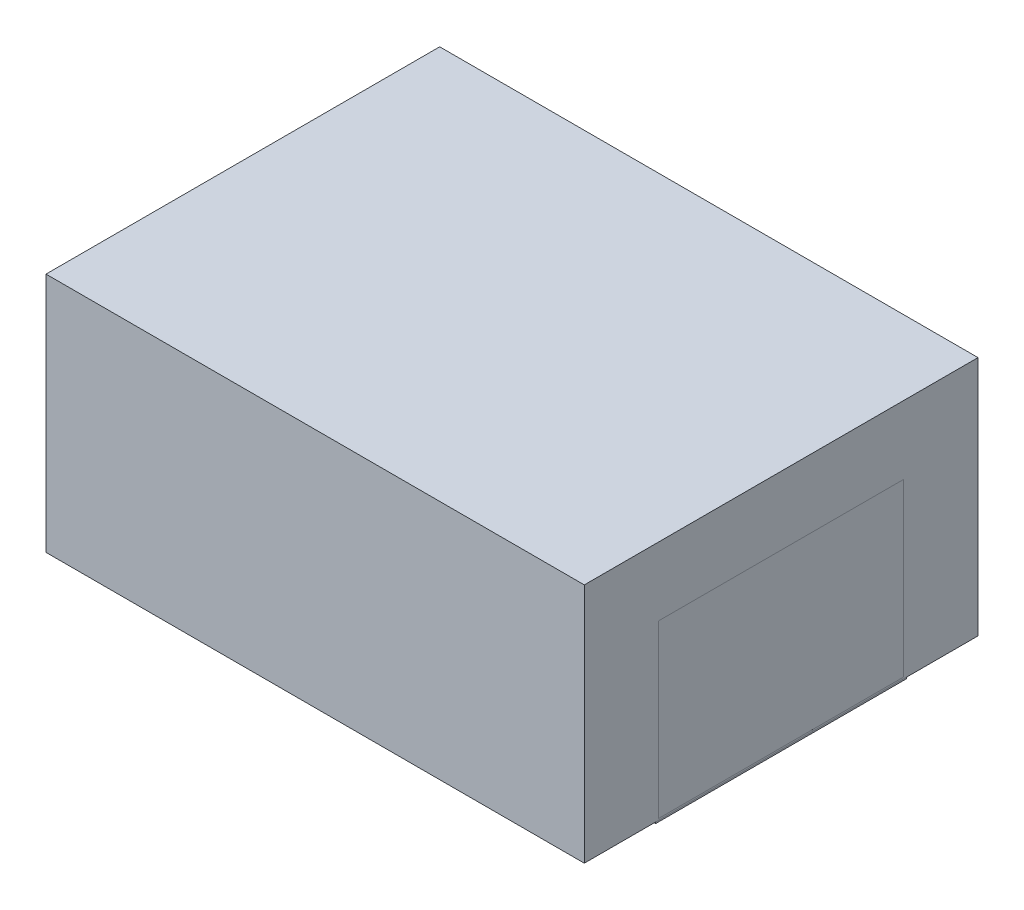
ISO-10303-21;
HEADER;
FILE_DESCRIPTION(('STEP AP214'),'2;1');
FILE_NAME('part.step','',(''),(''),'','','');
FILE_SCHEMA(('AUTOMOTIVE_DESIGN { 1 0 10303 214 1 1 1 1 }'));
ENDSEC;
DATA;
#1=APPLICATION_CONTEXT('core data for automotive mechanical design processes');
#2=APPLICATION_PROTOCOL_DEFINITION('international standard','automotive_design',2000,#1);
#3=PRODUCT_CONTEXT('',#1,'mechanical');
#4=PRODUCT('Part','Part','',(#3));
#5=PRODUCT_RELATED_PRODUCT_CATEGORY('part','',(#4));
#6=PRODUCT_DEFINITION_FORMATION('','',#4);
#7=PRODUCT_DEFINITION_CONTEXT('part definition',#1,'design');
#8=PRODUCT_DEFINITION('design','',#6,#7);
#9=PRODUCT_DEFINITION_SHAPE('','',#8);
#10=(LENGTH_UNIT() NAMED_UNIT(*) SI_UNIT(.MILLI.,.METRE.));
#11=(NAMED_UNIT(*) PLANE_ANGLE_UNIT() SI_UNIT($,.RADIAN.));
#12=(NAMED_UNIT(*) SI_UNIT($,.STERADIAN.) SOLID_ANGLE_UNIT());
#13=UNCERTAINTY_MEASURE_WITH_UNIT(LENGTH_MEASURE(1.E-05),#10,'distance_accuracy_value','');
#14=(GEOMETRIC_REPRESENTATION_CONTEXT(3) GLOBAL_UNCERTAINTY_ASSIGNED_CONTEXT((#13)) GLOBAL_UNIT_ASSIGNED_CONTEXT((#10,
#11,#12)) REPRESENTATION_CONTEXT('',''));
#15=CARTESIAN_POINT('',(0.,0.,0.));
#16=DIRECTION('',(0.,0.,1.));
#17=DIRECTION('',(1.,0.,0.));
#18=AXIS2_PLACEMENT_3D('',#15,#16,#17);
#19=CARTESIAN_POINT('',(6685.,0.,0.));
#20=DIRECTION('',(1.,0.,0.));
#21=DIRECTION('',(0.,0.,-1.));
#22=AXIS2_PLACEMENT_3D('',#19,#20,#21);
#23=PLANE('',#22);
#24=DIRECTION('',(0.,0.,1.));
#25=VECTOR('',#24,1.);
#26=CARTESIAN_POINT('',(6685.,2150.,3975.));
#27=LINE('',#26,#25);
#28=CARTESIAN_POINT('',(6685.,2150.,925.000000000002));
#29=VERTEX_POINT('',#28);
#30=CARTESIAN_POINT('',(6685.,2150.,3975.));
#31=VERTEX_POINT('',#30);
#32=EDGE_CURVE('P0_E285',#29,#31,#27,.T.);
#33=ORIENTED_EDGE('',*,*,#32,.T.);
#34=DIRECTION('',(0.,-1.,0.));
#35=VECTOR('',#34,1.);
#36=CARTESIAN_POINT('',(6685.,2150.,3975.));
#37=LINE('',#36,#35);
#38=CARTESIAN_POINT('',(6685.,19.9999999999993,3975.));
#39=VERTEX_POINT('',#38);
#40=EDGE_CURVE('P0_E275',#31,#39,#37,.T.);
#41=ORIENTED_EDGE('',*,*,#40,.T.);
#42=DIRECTION('',(0.,0.,-1.));
#43=VECTOR('',#42,1.);
#44=CARTESIAN_POINT('',(6685.,19.9999999999993,3975.));
#45=LINE('',#44,#43);
#46=CARTESIAN_POINT('',(6685.,19.9999999999991,925.000000000002));
#47=VERTEX_POINT('',#46);
#48=EDGE_CURVE('P0_E278',#39,#47,#45,.T.);
#49=ORIENTED_EDGE('',*,*,#48,.T.);
#50=DIRECTION('',(0.,1.,0.));
#51=VECTOR('',#50,1.);
#52=CARTESIAN_POINT('',(6685.,2150.,925.000000000002));
#53=LINE('',#52,#51);
#54=EDGE_CURVE('P0_E282',#47,#29,#53,.T.);
#55=ORIENTED_EDGE('',*,*,#54,.T.);
#56=EDGE_LOOP('',(#33,#41,#49,#55));
#57=FACE_BOUND('',#56,.T.);
#58=DIRECTION('',(0.,-1.,0.));
#59=VECTOR('',#58,1.);
#60=CARTESIAN_POINT('',(6685.,2985.,4885.));
#61=LINE('',#60,#59);
#62=CARTESIAN_POINT('',(6685.,2985.,4885.));
#63=VERTEX_POINT('',#62);
#64=CARTESIAN_POINT('',(6685.,15.,4885.));
#65=VERTEX_POINT('',#64);
#66=EDGE_CURVE('P0_E300',#63,#65,#61,.T.);
#67=ORIENTED_EDGE('',*,*,#66,.F.);
#68=DIRECTION('',(0.,0.,1.));
#69=VECTOR('',#68,1.);
#70=CARTESIAN_POINT('',(6685.,2985.,4885.));
#71=LINE('',#70,#69);
#72=CARTESIAN_POINT('',(6685.,2985.,15.));
#73=VERTEX_POINT('',#72);
#74=EDGE_CURVE('P0_E315',#73,#63,#71,.T.);
#75=ORIENTED_EDGE('',*,*,#74,.F.);
#76=DIRECTION('',(0.,1.,0.));
#77=VECTOR('',#76,1.);
#78=CARTESIAN_POINT('',(6685.,2985.,15.));
#79=LINE('',#78,#77);
#80=CARTESIAN_POINT('',(6685.,15.,15.));
#81=VERTEX_POINT('',#80);
#82=EDGE_CURVE('P0_E312',#81,#73,#79,.T.);
#83=ORIENTED_EDGE('',*,*,#82,.F.);
#84=DIRECTION('',(0.,0.,-1.));
#85=VECTOR('',#84,1.);
#86=CARTESIAN_POINT('',(6685.,15.,4885.));
#87=LINE('',#86,#85);
#88=EDGE_CURVE('P0_E309',#65,#81,#87,.T.);
#89=ORIENTED_EDGE('',*,*,#88,.F.);
#90=EDGE_LOOP('',(#67,#75,#83,#89));
#91=FACE_BOUND('',#90,.T.);
#92=ADVANCED_FACE('P0_F67',(#57,#91),#23,.F.);
#93=CARTESIAN_POINT('',(15.,0.,0.));
#94=DIRECTION('',(-1.,0.,0.));
#95=DIRECTION('',(0.,0.,1.));
#96=AXIS2_PLACEMENT_3D('',#93,#94,#95);
#97=PLANE('',#96);
#98=DIRECTION('',(0.,-1.,0.));
#99=VECTOR('',#98,1.);
#100=CARTESIAN_POINT('',(15.,2985.,15.));
#101=LINE('',#100,#99);
#102=CARTESIAN_POINT('',(15.,2985.,15.));
#103=VERTEX_POINT('',#102);
#104=CARTESIAN_POINT('',(15.,14.9999999999993,15.));
#105=VERTEX_POINT('',#104);
#106=EDGE_CURVE('P0_E318',#103,#105,#101,.T.);
#107=ORIENTED_EDGE('',*,*,#106,.F.);
#108=DIRECTION('',(0.,0.,-1.));
#109=VECTOR('',#108,1.);
#110=CARTESIAN_POINT('',(15.,2985.,15.));
#111=LINE('',#110,#109);
#112=CARTESIAN_POINT('',(15.,2985.,4885.));
#113=VERTEX_POINT('',#112);
#114=EDGE_CURVE('P0_E327',#113,#103,#111,.T.);
#115=ORIENTED_EDGE('',*,*,#114,.F.);
#116=DIRECTION('',(0.,1.,0.));
#117=VECTOR('',#116,1.);
#118=CARTESIAN_POINT('',(15.,2985.,4885.));
#119=LINE('',#118,#117);
#120=CARTESIAN_POINT('',(15.0000000000015,14.9999999999993,4885.));
#121=VERTEX_POINT('',#120);
#122=EDGE_CURVE('P0_E324',#121,#113,#119,.T.);
#123=ORIENTED_EDGE('',*,*,#122,.F.);
#124=DIRECTION('',(0.,0.,1.));
#125=VECTOR('',#124,1.);
#126=CARTESIAN_POINT('',(15.,14.9999999999993,15.));
#127=LINE('',#126,#125);
#128=EDGE_CURVE('P0_E321',#105,#121,#127,.T.);
#129=ORIENTED_EDGE('',*,*,#128,.F.);
#130=EDGE_LOOP('',(#107,#115,#123,#129));
#131=FACE_BOUND('',#130,.T.);
#132=ADVANCED_FACE('P0_F391',(#131),#97,.F.);
#133=CARTESIAN_POINT('',(6700.,15.,0.));
#134=DIRECTION('',(0.,1.,0.));
#135=DIRECTION('',(0.,0.,1.));
#136=AXIS2_PLACEMENT_3D('',#133,#134,#135);
#137=PLANE('',#136);
#138=DIRECTION('',(-1.,0.,0.));
#139=VECTOR('',#138,1.);
#140=CARTESIAN_POINT('',(6700.,14.9999999999993,4885.));
#141=LINE('',#140,#139);
#142=EDGE_CURVE('P0_E332',#65,#121,#141,.T.);
#143=ORIENTED_EDGE('',*,*,#142,.F.);
#144=ORIENTED_EDGE('',*,*,#88,.T.);
#145=DIRECTION('',(-1.,0.,0.));
#146=VECTOR('',#145,1.);
#147=CARTESIAN_POINT('',(6700.,15.,15.));
#148=LINE('',#147,#146);
#149=EDGE_CURVE('P0_E330',#81,#105,#148,.T.);
#150=ORIENTED_EDGE('',*,*,#149,.T.);
#151=ORIENTED_EDGE('',*,*,#128,.T.);
#152=EDGE_LOOP('',(#143,#144,#150,#151));
#153=FACE_BOUND('',#152,.T.);
#154=ADVANCED_FACE('P0_F397',(#153),#137,.T.);
#155=CARTESIAN_POINT('',(6700.,-7.20323747215018E-13,4885.));
#156=DIRECTION('',(0.,0.,-1.));
#157=DIRECTION('',(-1.,0.,0.));
#158=AXIS2_PLACEMENT_3D('',#155,#156,#157);
#159=PLANE('',#158);
#160=DIRECTION('',(-1.,0.,0.));
#161=VECTOR('',#160,1.);
#162=CARTESIAN_POINT('',(6700.,2985.,4885.));
#163=LINE('',#162,#161);
#164=EDGE_CURVE('P0_E334',#63,#113,#163,.T.);
#165=ORIENTED_EDGE('',*,*,#164,.F.);
#166=ORIENTED_EDGE('',*,*,#66,.T.);
#167=ORIENTED_EDGE('',*,*,#142,.T.);
#168=ORIENTED_EDGE('',*,*,#122,.T.);
#169=EDGE_LOOP('',(#165,#166,#167,#168));
#170=FACE_BOUND('',#169,.T.);
#171=ADVANCED_FACE('P0_F407',(#170),#159,.T.);
#172=CARTESIAN_POINT('',(6700.,2985.,0.));
#173=DIRECTION('',(0.,-1.,0.));
#174=DIRECTION('',(0.,0.,-1.));
#175=AXIS2_PLACEMENT_3D('',#172,#173,#174);
#176=PLANE('',#175);
#177=DIRECTION('',(-1.,0.,0.));
#178=VECTOR('',#177,1.);
#179=CARTESIAN_POINT('',(6700.,2985.,15.));
#180=LINE('',#179,#178);
#181=EDGE_CURVE('P0_E336',#73,#103,#180,.T.);
#182=ORIENTED_EDGE('',*,*,#181,.F.);
#183=ORIENTED_EDGE('',*,*,#74,.T.);
#184=ORIENTED_EDGE('',*,*,#164,.T.);
#185=ORIENTED_EDGE('',*,*,#114,.T.);
#186=EDGE_LOOP('',(#182,#183,#184,#185));
#187=FACE_BOUND('',#186,.T.);
#188=ADVANCED_FACE('P0_F411',(#187),#176,.T.);
#189=CARTESIAN_POINT('',(6700.,0.,15.));
#190=DIRECTION('',(0.,0.,1.));
#191=DIRECTION('',(1.,0.,0.));
#192=AXIS2_PLACEMENT_3D('',#189,#190,#191);
#193=PLANE('',#192);
#194=DIRECTION('',(0.,-1.,0.));
#195=VECTOR('',#194,1.);
#196=CARTESIAN_POINT('',(5378.9879192172,2110.,15.));
#197=LINE('',#196,#195);
#198=CARTESIAN_POINT('',(5378.9879192172,2110.,15.));
#199=VERTEX_POINT('',#198);
#200=CARTESIAN_POINT('',(5378.9879192172,890.,15.));
#201=VERTEX_POINT('',#200);
#202=EDGE_CURVE('P0_E208',#199,#201,#197,.T.);
#203=ORIENTED_EDGE('',*,*,#202,.T.);
#204=DIRECTION('',(-1.,0.,0.));
#205=VECTOR('',#204,1.);
#206=CARTESIAN_POINT('',(5378.9879192172,890.,15.));
#207=LINE('',#206,#205);
#208=CARTESIAN_POINT('',(4458.9879192172,890.,15.));
#209=VERTEX_POINT('',#208);
#210=EDGE_CURVE('P0_E219',#201,#209,#207,.T.);
#211=ORIENTED_EDGE('',*,*,#210,.T.);
#212=DIRECTION('',(0.,1.,0.));
#213=VECTOR('',#212,1.);
#214=CARTESIAN_POINT('',(4458.9879192172,2110.,15.));
#215=LINE('',#214,#213);
#216=CARTESIAN_POINT('',(4458.9879192172,2110.,15.));
#217=VERTEX_POINT('',#216);
#218=EDGE_CURVE('P0_E82',#209,#217,#215,.T.);
#219=ORIENTED_EDGE('',*,*,#218,.T.);
#220=DIRECTION('',(1.,0.,0.));
#221=VECTOR('',#220,1.);
#222=CARTESIAN_POINT('',(5378.9879192172,2110.,15.));
#223=LINE('',#222,#221);
#224=EDGE_CURVE('P0_E216',#217,#199,#223,.T.);
#225=ORIENTED_EDGE('',*,*,#224,.T.);
#226=EDGE_LOOP('',(#203,#211,#219,#225));
#227=FACE_BOUND('',#226,.T.);
#228=DIRECTION('',(0.,-1.,0.));
#229=VECTOR('',#228,1.);
#230=CARTESIAN_POINT('',(2858.9879192172,2110.,15.));
#231=LINE('',#230,#229);
#232=CARTESIAN_POINT('',(2858.9879192172,2110.,15.));
#233=VERTEX_POINT('',#232);
#234=CARTESIAN_POINT('',(2858.9879192172,890.,15.));
#235=VERTEX_POINT('',#234);
#236=EDGE_CURVE('P0_E246',#233,#235,#231,.T.);
#237=ORIENTED_EDGE('',*,*,#236,.T.);
#238=DIRECTION('',(-1.,0.,0.));
#239=VECTOR('',#238,1.);
#240=CARTESIAN_POINT('',(2858.9879192172,890.,15.));
#241=LINE('',#240,#239);
#242=CARTESIAN_POINT('',(1938.9879192172,890.,15.));
#243=VERTEX_POINT('',#242);
#244=EDGE_CURVE('P0_E249',#235,#243,#241,.T.);
#245=ORIENTED_EDGE('',*,*,#244,.T.);
#246=DIRECTION('',(0.,1.,0.));
#247=VECTOR('',#246,1.);
#248=CARTESIAN_POINT('',(1938.9879192172,2110.,15.));
#249=LINE('',#248,#247);
#250=CARTESIAN_POINT('',(1938.9879192172,2110.,15.));
#251=VERTEX_POINT('',#250);
#252=EDGE_CURVE('P0_E90',#243,#251,#249,.T.);
#253=ORIENTED_EDGE('',*,*,#252,.T.);
#254=DIRECTION('',(1.,0.,0.));
#255=VECTOR('',#254,1.);
#256=CARTESIAN_POINT('',(2858.9879192172,2110.,15.));
#257=LINE('',#256,#255);
#258=EDGE_CURVE('P0_E254',#251,#233,#257,.T.);
#259=ORIENTED_EDGE('',*,*,#258,.T.);
#260=EDGE_LOOP('',(#237,#245,#253,#259));
#261=FACE_BOUND('',#260,.T.);
#262=ORIENTED_EDGE('',*,*,#149,.F.);
#263=ORIENTED_EDGE('',*,*,#82,.T.);
#264=ORIENTED_EDGE('',*,*,#181,.T.);
#265=ORIENTED_EDGE('',*,*,#106,.T.);
#266=EDGE_LOOP('',(#262,#263,#264,#265));
#267=FACE_BOUND('',#266,.T.);
#268=ADVANCED_FACE('P0_F223',(#227,#261,#267),#193,.T.);
#269=CARTESIAN_POINT('',(6685.,2150.,3975.));
#270=DIRECTION('',(0.,0.,1.));
#271=DIRECTION('',(0.,-1.,0.));
#272=AXIS2_PLACEMENT_3D('',#269,#270,#271);
#273=PLANE('',#272);
#274=DIRECTION('',(0.,-1.,0.));
#275=VECTOR('',#274,1.);
#276=CARTESIAN_POINT('',(6700.,2150.,3975.));
#277=LINE('',#276,#275);
#278=CARTESIAN_POINT('',(6700.,2150.,3975.));
#279=VERTEX_POINT('',#278);
#280=CARTESIAN_POINT('',(6700.,19.9999999999993,3975.));
#281=VERTEX_POINT('',#280);
#282=EDGE_CURVE('P0_E242',#279,#281,#277,.T.);
#283=ORIENTED_EDGE('',*,*,#282,.T.);
#284=DIRECTION('',(1.,0.,0.));
#285=VECTOR('',#284,1.);
#286=CARTESIAN_POINT('',(6685.,19.9999999999993,3975.));
#287=LINE('',#286,#285);
#288=EDGE_CURVE('P0_E288',#39,#281,#287,.T.);
#289=ORIENTED_EDGE('',*,*,#288,.F.);
#290=ORIENTED_EDGE('',*,*,#40,.F.);
#291=DIRECTION('',(1.,0.,0.));
#292=VECTOR('',#291,1.);
#293=CARTESIAN_POINT('',(6685.,2150.,3975.));
#294=LINE('',#293,#292);
#295=EDGE_CURVE('P0_E298',#31,#279,#294,.T.);
#296=ORIENTED_EDGE('',*,*,#295,.T.);
#297=EDGE_LOOP('',(#283,#289,#290,#296));
#298=FACE_BOUND('',#297,.T.);
#299=ADVANCED_FACE('P0_F402',(#298),#273,.F.);
#300=CARTESIAN_POINT('',(6685.,2150.,3975.));
#301=DIRECTION('',(0.,1.,0.));
#302=DIRECTION('',(0.,0.,1.));
#303=AXIS2_PLACEMENT_3D('',#300,#301,#302);
#304=PLANE('',#303);
#305=DIRECTION('',(0.,0.,1.));
#306=VECTOR('',#305,1.);
#307=CARTESIAN_POINT('',(6700.,2150.,3975.));
#308=LINE('',#307,#306);
#309=CARTESIAN_POINT('',(6700.,2150.,925.000000000002));
#310=VERTEX_POINT('',#309);
#311=EDGE_CURVE('P0_E279',#310,#279,#308,.T.);
#312=ORIENTED_EDGE('',*,*,#311,.T.);
#313=ORIENTED_EDGE('',*,*,#295,.F.);
#314=ORIENTED_EDGE('',*,*,#32,.F.);
#315=DIRECTION('',(1.,0.,0.));
#316=VECTOR('',#315,1.);
#317=CARTESIAN_POINT('',(6685.,2150.,925.000000000002));
#318=LINE('',#317,#316);
#319=EDGE_CURVE('P0_E301',#29,#310,#318,.T.);
#320=ORIENTED_EDGE('',*,*,#319,.T.);
#321=EDGE_LOOP('',(#312,#313,#314,#320));
#322=FACE_BOUND('',#321,.T.);
#323=ADVANCED_FACE('P0_F442',(#322),#304,.F.);
#324=CARTESIAN_POINT('',(6685.,2150.,925.000000000002));
#325=DIRECTION('',(0.,0.,-1.));
#326=DIRECTION('',(0.,1.,0.));
#327=AXIS2_PLACEMENT_3D('',#324,#325,#326);
#328=PLANE('',#327);
#329=DIRECTION('',(0.,1.,0.));
#330=VECTOR('',#329,1.);
#331=CARTESIAN_POINT('',(6700.,2150.,925.000000000002));
#332=LINE('',#331,#330);
#333=CARTESIAN_POINT('',(6700.,19.9999999999991,925.000000000002));
#334=VERTEX_POINT('',#333);
#335=EDGE_CURVE('P0_E293',#334,#310,#332,.T.);
#336=ORIENTED_EDGE('',*,*,#335,.T.);
#337=ORIENTED_EDGE('',*,*,#319,.F.);
#338=ORIENTED_EDGE('',*,*,#54,.F.);
#339=DIRECTION('',(1.,0.,0.));
#340=VECTOR('',#339,1.);
#341=CARTESIAN_POINT('',(6685.,19.9999999999991,925.000000000002));
#342=LINE('',#341,#340);
#343=EDGE_CURVE('P0_E303',#47,#334,#342,.T.);
#344=ORIENTED_EDGE('',*,*,#343,.T.);
#345=EDGE_LOOP('',(#336,#337,#338,#344));
#346=FACE_BOUND('',#345,.T.);
#347=ADVANCED_FACE('P0_F445',(#346),#328,.F.);
#348=CARTESIAN_POINT('',(6685.,19.9999999999993,3975.));
#349=DIRECTION('',(0.,-1.,0.));
#350=DIRECTION('',(0.,0.,-1.));
#351=AXIS2_PLACEMENT_3D('',#348,#349,#350);
#352=PLANE('',#351);
#353=DIRECTION('',(0.,0.,-1.));
#354=VECTOR('',#353,1.);
#355=CARTESIAN_POINT('',(6700.,19.9999999999993,3975.));
#356=LINE('',#355,#354);
#357=EDGE_CURVE('P0_E290',#281,#334,#356,.T.);
#358=ORIENTED_EDGE('',*,*,#357,.T.);
#359=ORIENTED_EDGE('',*,*,#343,.F.);
#360=ORIENTED_EDGE('',*,*,#48,.F.);
#361=ORIENTED_EDGE('',*,*,#288,.T.);
#362=EDGE_LOOP('',(#358,#359,#360,#361));
#363=FACE_BOUND('',#362,.T.);
#364=ADVANCED_FACE('P0_F420',(#363),#352,.F.);
#365=CARTESIAN_POINT('',(6700.,0.,0.));
#366=DIRECTION('',(1.,0.,0.));
#367=DIRECTION('',(0.,0.,-1.));
#368=AXIS2_PLACEMENT_3D('',#365,#366,#367);
#369=PLANE('',#368);
#370=ORIENTED_EDGE('',*,*,#282,.F.);
#371=ORIENTED_EDGE('',*,*,#311,.F.);
#372=ORIENTED_EDGE('',*,*,#335,.F.);
#373=ORIENTED_EDGE('',*,*,#357,.F.);
#374=EDGE_LOOP('',(#370,#371,#372,#373));
#375=FACE_BOUND('',#374,.T.);
#376=DIRECTION('',(0.,1.,0.));
#377=VECTOR('',#376,1.);
#378=CARTESIAN_POINT('',(6700.,0.,0.));
#379=LINE('',#378,#377);
#380=CARTESIAN_POINT('',(6700.,0.,0.));
#381=VERTEX_POINT('',#380);
#382=CARTESIAN_POINT('',(6700.,3000.,0.));
#383=VERTEX_POINT('',#382);
#384=EDGE_CURVE('P0_E339',#381,#383,#379,.T.);
#385=ORIENTED_EDGE('',*,*,#384,.T.);
#386=DIRECTION('',(0.,0.,1.));
#387=VECTOR('',#386,1.);
#388=CARTESIAN_POINT('',(6700.,3000.,0.));
#389=LINE('',#388,#387);
#390=CARTESIAN_POINT('',(6700.,3000.,4900.));
#391=VERTEX_POINT('',#390);
#392=EDGE_CURVE('P0_E342',#383,#391,#389,.T.);
#393=ORIENTED_EDGE('',*,*,#392,.T.);
#394=DIRECTION('',(0.,-1.,0.));
#395=VECTOR('',#394,1.);
#396=CARTESIAN_POINT('',(6700.,-7.20323747215018E-13,4900.));
#397=LINE('',#396,#395);
#398=CARTESIAN_POINT('',(6700.,-7.20323747215018E-13,4900.));
#399=VERTEX_POINT('',#398);
#400=EDGE_CURVE('P0_E345',#391,#399,#397,.T.);
#401=ORIENTED_EDGE('',*,*,#400,.T.);
#402=DIRECTION('',(0.,0.,-1.));
#403=VECTOR('',#402,1.);
#404=CARTESIAN_POINT('',(6700.,0.,0.));
#405=LINE('',#404,#403);
#406=EDGE_CURVE('P0_E347',#399,#381,#405,.T.);
#407=ORIENTED_EDGE('',*,*,#406,.T.);
#408=EDGE_LOOP('',(#385,#393,#401,#407));
#409=FACE_BOUND('',#408,.T.);
#410=ADVANCED_FACE('P0_F381',(#375,#409),#369,.T.);
#411=CARTESIAN_POINT('',(0.,0.,0.));
#412=DIRECTION('',(1.,0.,0.));
#413=DIRECTION('',(0.,0.,-1.));
#414=AXIS2_PLACEMENT_3D('',#411,#412,#413);
#415=PLANE('',#414);
#416=DIRECTION('',(0.,1.,0.));
#417=VECTOR('',#416,1.);
#418=CARTESIAN_POINT('',(0.,0.,0.));
#419=LINE('',#418,#417);
#420=CARTESIAN_POINT('',(0.,0.,0.));
#421=VERTEX_POINT('',#420);
#422=CARTESIAN_POINT('',(0.,3000.,0.));
#423=VERTEX_POINT('',#422);
#424=EDGE_CURVE('P0_E338',#421,#423,#419,.T.);
#425=ORIENTED_EDGE('',*,*,#424,.F.);
#426=DIRECTION('',(0.,0.,-1.));
#427=VECTOR('',#426,1.);
#428=CARTESIAN_POINT('',(0.,0.,0.));
#429=LINE('',#428,#427);
#430=CARTESIAN_POINT('',(0.,-7.20323747215018E-13,4900.));
#431=VERTEX_POINT('',#430);
#432=EDGE_CURVE('P0_E343',#431,#421,#429,.T.);
#433=ORIENTED_EDGE('',*,*,#432,.F.);
#434=DIRECTION('',(0.,-1.,0.));
#435=VECTOR('',#434,1.);
#436=CARTESIAN_POINT('',(0.,-7.20323747215018E-13,4900.));
#437=LINE('',#436,#435);
#438=CARTESIAN_POINT('',(0.,3000.,4900.));
#439=VERTEX_POINT('',#438);
#440=EDGE_CURVE('P0_E354',#439,#431,#437,.T.);
#441=ORIENTED_EDGE('',*,*,#440,.F.);
#442=DIRECTION('',(0.,0.,1.));
#443=VECTOR('',#442,1.);
#444=CARTESIAN_POINT('',(0.,3000.,0.));
#445=LINE('',#444,#443);
#446=EDGE_CURVE('P0_E352',#423,#439,#445,.T.);
#447=ORIENTED_EDGE('',*,*,#446,.F.);
#448=EDGE_LOOP('',(#425,#433,#441,#447));
#449=FACE_BOUND('',#448,.T.);
#450=ADVANCED_FACE('P0_F372',(#449),#415,.F.);
#451=CARTESIAN_POINT('',(6700.,0.,0.));
#452=DIRECTION('',(0.,0.,1.));
#453=DIRECTION('',(1.,0.,0.));
#454=AXIS2_PLACEMENT_3D('',#451,#452,#453);
#455=PLANE('',#454);
#456=DIRECTION('',(-1.,0.,0.));
#457=VECTOR('',#456,1.);
#458=CARTESIAN_POINT('',(5378.9879192172,890.,0.));
#459=LINE('',#458,#457);
#460=CARTESIAN_POINT('',(5378.9879192172,890.,0.));
#461=VERTEX_POINT('',#460);
#462=CARTESIAN_POINT('',(4458.9879192172,890.,0.));
#463=VERTEX_POINT('',#462);
#464=EDGE_CURVE('P0_E235',#461,#463,#459,.T.);
#465=ORIENTED_EDGE('',*,*,#464,.F.);
#466=DIRECTION('',(0.,-1.,0.));
#467=VECTOR('',#466,1.);
#468=CARTESIAN_POINT('',(5378.9879192172,2110.,0.));
#469=LINE('',#468,#467);
#470=CARTESIAN_POINT('',(5378.9879192172,2110.,0.));
#471=VERTEX_POINT('',#470);
#472=EDGE_CURVE('P0_E211',#471,#461,#469,.T.);
#473=ORIENTED_EDGE('',*,*,#472,.F.);
#474=DIRECTION('',(1.,0.,0.));
#475=VECTOR('',#474,1.);
#476=CARTESIAN_POINT('',(5378.9879192172,2110.,0.));
#477=LINE('',#476,#475);
#478=CARTESIAN_POINT('',(4458.9879192172,2110.,0.));
#479=VERTEX_POINT('',#478);
#480=EDGE_CURVE('P0_E226',#479,#471,#477,.T.);
#481=ORIENTED_EDGE('',*,*,#480,.F.);
#482=DIRECTION('',(0.,1.,0.));
#483=VECTOR('',#482,1.);
#484=CARTESIAN_POINT('',(4458.9879192172,2110.,0.));
#485=LINE('',#484,#483);
#486=EDGE_CURVE('P0_E229',#463,#479,#485,.T.);
#487=ORIENTED_EDGE('',*,*,#486,.F.);
#488=EDGE_LOOP('',(#465,#473,#481,#487));
#489=FACE_BOUND('',#488,.T.);
#490=DIRECTION('',(-1.,0.,0.));
#491=VECTOR('',#490,1.);
#492=CARTESIAN_POINT('',(2858.9879192172,890.,0.));
#493=LINE('',#492,#491);
#494=CARTESIAN_POINT('',(2858.9879192172,890.,0.));
#495=VERTEX_POINT('',#494);
#496=CARTESIAN_POINT('',(1938.9879192172,890.,0.));
#497=VERTEX_POINT('',#496);
#498=EDGE_CURVE('P0_E260',#495,#497,#493,.T.);
#499=ORIENTED_EDGE('',*,*,#498,.F.);
#500=DIRECTION('',(0.,-1.,0.));
#501=VECTOR('',#500,1.);
#502=CARTESIAN_POINT('',(2858.9879192172,2110.,0.));
#503=LINE('',#502,#501);
#504=CARTESIAN_POINT('',(2858.9879192172,2110.,0.));
#505=VERTEX_POINT('',#504);
#506=EDGE_CURVE('P0_E258',#505,#495,#503,.T.);
#507=ORIENTED_EDGE('',*,*,#506,.F.);
#508=DIRECTION('',(1.,0.,0.));
#509=VECTOR('',#508,1.);
#510=CARTESIAN_POINT('',(2858.9879192172,2110.,0.));
#511=LINE('',#510,#509);
#512=CARTESIAN_POINT('',(1938.9879192172,2110.,0.));
#513=VERTEX_POINT('',#512);
#514=EDGE_CURVE('P0_E250',#513,#505,#511,.T.);
#515=ORIENTED_EDGE('',*,*,#514,.F.);
#516=DIRECTION('',(0.,1.,0.));
#517=VECTOR('',#516,1.);
#518=CARTESIAN_POINT('',(1938.9879192172,2110.,0.));
#519=LINE('',#518,#517);
#520=EDGE_CURVE('P0_E263',#497,#513,#519,.T.);
#521=ORIENTED_EDGE('',*,*,#520,.F.);
#522=EDGE_LOOP('',(#499,#507,#515,#521));
#523=FACE_BOUND('',#522,.T.);
#524=ORIENTED_EDGE('',*,*,#424,.T.);
#525=DIRECTION('',(-1.,0.,0.));
#526=VECTOR('',#525,1.);
#527=CARTESIAN_POINT('',(6700.,3000.,0.));
#528=LINE('',#527,#526);
#529=EDGE_CURVE('P0_E12',#383,#423,#528,.T.);
#530=ORIENTED_EDGE('',*,*,#529,.F.);
#531=ORIENTED_EDGE('',*,*,#384,.F.);
#532=DIRECTION('',(-1.,0.,0.));
#533=VECTOR('',#532,1.);
#534=CARTESIAN_POINT('',(6700.,0.,0.));
#535=LINE('',#534,#533);
#536=EDGE_CURVE('P0_E349',#381,#421,#535,.T.);
#537=ORIENTED_EDGE('',*,*,#536,.T.);
#538=EDGE_LOOP('',(#524,#530,#531,#537));
#539=FACE_BOUND('',#538,.T.);
#540=ADVANCED_FACE('P0_F69',(#489,#523,#539),#455,.F.);
#541=CARTESIAN_POINT('',(6700.,3000.,0.));
#542=DIRECTION('',(0.,-1.,0.));
#543=DIRECTION('',(0.,0.,-1.));
#544=AXIS2_PLACEMENT_3D('',#541,#542,#543);
#545=PLANE('',#544);
#546=ORIENTED_EDGE('',*,*,#446,.T.);
#547=DIRECTION('',(-1.,0.,0.));
#548=VECTOR('',#547,1.);
#549=CARTESIAN_POINT('',(6700.,3000.,4900.));
#550=LINE('',#549,#548);
#551=EDGE_CURVE('P0_E75',#391,#439,#550,.T.);
#552=ORIENTED_EDGE('',*,*,#551,.F.);
#553=ORIENTED_EDGE('',*,*,#392,.F.);
#554=ORIENTED_EDGE('',*,*,#529,.T.);
#555=EDGE_LOOP('',(#546,#552,#553,#554));
#556=FACE_BOUND('',#555,.T.);
#557=ADVANCED_FACE('P0_F382',(#556),#545,.F.);
#558=CARTESIAN_POINT('',(6700.,-7.20323747215018E-13,4900.));
#559=DIRECTION('',(0.,0.,-1.));
#560=DIRECTION('',(-1.,0.,0.));
#561=AXIS2_PLACEMENT_3D('',#558,#559,#560);
#562=PLANE('',#561);
#563=ORIENTED_EDGE('',*,*,#440,.T.);
#564=DIRECTION('',(-1.,0.,0.));
#565=VECTOR('',#564,1.);
#566=CARTESIAN_POINT('',(6700.,-7.20323747215018E-13,4900.));
#567=LINE('',#566,#565);
#568=EDGE_CURVE('P0_E359',#399,#431,#567,.T.);
#569=ORIENTED_EDGE('',*,*,#568,.F.);
#570=ORIENTED_EDGE('',*,*,#400,.F.);
#571=ORIENTED_EDGE('',*,*,#551,.T.);
#572=EDGE_LOOP('',(#563,#569,#570,#571));
#573=FACE_BOUND('',#572,.T.);
#574=ADVANCED_FACE('P0_F366',(#573),#562,.F.);
#575=CARTESIAN_POINT('',(6700.,0.,0.));
#576=DIRECTION('',(0.,1.,0.));
#577=DIRECTION('',(0.,0.,1.));
#578=AXIS2_PLACEMENT_3D('',#575,#576,#577);
#579=PLANE('',#578);
#580=ORIENTED_EDGE('',*,*,#432,.T.);
#581=ORIENTED_EDGE('',*,*,#536,.F.);
#582=ORIENTED_EDGE('',*,*,#406,.F.);
#583=ORIENTED_EDGE('',*,*,#568,.T.);
#584=EDGE_LOOP('',(#580,#581,#582,#583));
#585=FACE_BOUND('',#584,.T.);
#586=ADVANCED_FACE('P0_F375',(#585),#579,.F.);
#587=CARTESIAN_POINT('',(2858.9879192172,2110.,15.));
#588=DIRECTION('',(1.,0.,0.));
#589=DIRECTION('',(0.,0.,-1.));
#590=AXIS2_PLACEMENT_3D('',#587,#588,#589);
#591=PLANE('',#590);
#592=ORIENTED_EDGE('',*,*,#506,.T.);
#593=DIRECTION('',(0.,0.,-1.));
#594=VECTOR('',#593,1.);
#595=CARTESIAN_POINT('',(2858.9879192172,890.,15.));
#596=LINE('',#595,#594);
#597=EDGE_CURVE('P0_E257',#235,#495,#596,.T.);
#598=ORIENTED_EDGE('',*,*,#597,.F.);
#599=ORIENTED_EDGE('',*,*,#236,.F.);
#600=DIRECTION('',(0.,0.,-1.));
#601=VECTOR('',#600,1.);
#602=CARTESIAN_POINT('',(2858.9879192172,2110.,15.));
#603=LINE('',#602,#601);
#604=EDGE_CURVE('P0_E236',#233,#505,#603,.T.);
#605=ORIENTED_EDGE('',*,*,#604,.T.);
#606=EDGE_LOOP('',(#592,#598,#599,#605));
#607=FACE_BOUND('',#606,.T.);
#608=ADVANCED_FACE('P0_F425',(#607),#591,.F.);
#609=CARTESIAN_POINT('',(2858.9879192172,2110.,15.));
#610=DIRECTION('',(0.,1.,0.));
#611=DIRECTION('',(0.,0.,1.));
#612=AXIS2_PLACEMENT_3D('',#609,#610,#611);
#613=PLANE('',#612);
#614=ORIENTED_EDGE('',*,*,#514,.T.);
#615=ORIENTED_EDGE('',*,*,#604,.F.);
#616=ORIENTED_EDGE('',*,*,#258,.F.);
#617=DIRECTION('',(0.,0.,-1.));
#618=VECTOR('',#617,1.);
#619=CARTESIAN_POINT('',(1938.9879192172,2110.,15.));
#620=LINE('',#619,#618);
#621=EDGE_CURVE('P0_E269',#251,#513,#620,.T.);
#622=ORIENTED_EDGE('',*,*,#621,.T.);
#623=EDGE_LOOP('',(#614,#615,#616,#622));
#624=FACE_BOUND('',#623,.T.);
#625=ADVANCED_FACE('P0_F429',(#624),#613,.F.);
#626=CARTESIAN_POINT('',(1938.9879192172,2110.,15.));
#627=DIRECTION('',(-1.,0.,0.));
#628=DIRECTION('',(0.,0.,1.));
#629=AXIS2_PLACEMENT_3D('',#626,#627,#628);
#630=PLANE('',#629);
#631=ORIENTED_EDGE('',*,*,#520,.T.);
#632=ORIENTED_EDGE('',*,*,#621,.F.);
#633=ORIENTED_EDGE('',*,*,#252,.F.);
#634=DIRECTION('',(0.,0.,-1.));
#635=VECTOR('',#634,1.);
#636=CARTESIAN_POINT('',(1938.9879192172,890.,15.));
#637=LINE('',#636,#635);
#638=EDGE_CURVE('P0_E271',#243,#497,#637,.T.);
#639=ORIENTED_EDGE('',*,*,#638,.T.);
#640=EDGE_LOOP('',(#631,#632,#633,#639));
#641=FACE_BOUND('',#640,.T.);
#642=ADVANCED_FACE('P0_F435',(#641),#630,.F.);
#643=CARTESIAN_POINT('',(2858.9879192172,890.,15.));
#644=DIRECTION('',(0.,-1.,0.));
#645=DIRECTION('',(1.,0.,0.));
#646=AXIS2_PLACEMENT_3D('',#643,#644,#645);
#647=PLANE('',#646);
#648=ORIENTED_EDGE('',*,*,#498,.T.);
#649=ORIENTED_EDGE('',*,*,#638,.F.);
#650=ORIENTED_EDGE('',*,*,#244,.F.);
#651=ORIENTED_EDGE('',*,*,#597,.T.);
#652=EDGE_LOOP('',(#648,#649,#650,#651));
#653=FACE_BOUND('',#652,.T.);
#654=ADVANCED_FACE('P0_F440',(#653),#647,.F.);
#655=CARTESIAN_POINT('',(5378.9879192172,2110.,15.));
#656=DIRECTION('',(1.,0.,0.));
#657=DIRECTION('',(0.,0.,-1.));
#658=AXIS2_PLACEMENT_3D('',#655,#656,#657);
#659=PLANE('',#658);
#660=ORIENTED_EDGE('',*,*,#472,.T.);
#661=DIRECTION('',(0.,0.,-1.));
#662=VECTOR('',#661,1.);
#663=CARTESIAN_POINT('',(5378.9879192172,890.,15.));
#664=LINE('',#663,#662);
#665=EDGE_CURVE('P0_E204',#201,#461,#664,.T.);
#666=ORIENTED_EDGE('',*,*,#665,.F.);
#667=ORIENTED_EDGE('',*,*,#202,.F.);
#668=DIRECTION('',(0.,0.,-1.));
#669=VECTOR('',#668,1.);
#670=CARTESIAN_POINT('',(5378.9879192172,2110.,15.));
#671=LINE('',#670,#669);
#672=EDGE_CURVE('P0_E240',#199,#471,#671,.T.);
#673=ORIENTED_EDGE('',*,*,#672,.T.);
#674=EDGE_LOOP('',(#660,#666,#667,#673));
#675=FACE_BOUND('',#674,.T.);
#676=ADVANCED_FACE('P0_F206',(#675),#659,.F.);
#677=CARTESIAN_POINT('',(5378.9879192172,2110.,15.));
#678=DIRECTION('',(0.,1.,0.));
#679=DIRECTION('',(0.,0.,1.));
#680=AXIS2_PLACEMENT_3D('',#677,#678,#679);
#681=PLANE('',#680);
#682=ORIENTED_EDGE('',*,*,#480,.T.);
#683=ORIENTED_EDGE('',*,*,#672,.F.);
#684=ORIENTED_EDGE('',*,*,#224,.F.);
#685=DIRECTION('',(0.,0.,-1.));
#686=VECTOR('',#685,1.);
#687=CARTESIAN_POINT('',(4458.9879192172,2110.,15.));
#688=LINE('',#687,#686);
#689=EDGE_CURVE('P0_E243',#217,#479,#688,.T.);
#690=ORIENTED_EDGE('',*,*,#689,.T.);
#691=EDGE_LOOP('',(#682,#683,#684,#690));
#692=FACE_BOUND('',#691,.T.);
#693=ADVANCED_FACE('P0_F535',(#692),#681,.F.);
#694=CARTESIAN_POINT('',(4458.9879192172,2110.,15.));
#695=DIRECTION('',(-1.,0.,0.));
#696=DIRECTION('',(0.,0.,1.));
#697=AXIS2_PLACEMENT_3D('',#694,#695,#696);
#698=PLANE('',#697);
#699=ORIENTED_EDGE('',*,*,#486,.T.);
#700=ORIENTED_EDGE('',*,*,#689,.F.);
#701=ORIENTED_EDGE('',*,*,#218,.F.);
#702=DIRECTION('',(0.,0.,-1.));
#703=VECTOR('',#702,1.);
#704=CARTESIAN_POINT('',(4458.9879192172,890.,15.));
#705=LINE('',#704,#703);
#706=EDGE_CURVE('P0_E215',#209,#463,#705,.T.);
#707=ORIENTED_EDGE('',*,*,#706,.T.);
#708=EDGE_LOOP('',(#699,#700,#701,#707));
#709=FACE_BOUND('',#708,.T.);
#710=ADVANCED_FACE('P0_F544',(#709),#698,.F.);
#711=CARTESIAN_POINT('',(5378.9879192172,890.,15.));
#712=DIRECTION('',(0.,-1.,0.));
#713=DIRECTION('',(1.,0.,0.));
#714=AXIS2_PLACEMENT_3D('',#711,#712,#713);
#715=PLANE('',#714);
#716=ORIENTED_EDGE('',*,*,#464,.T.);
#717=ORIENTED_EDGE('',*,*,#706,.F.);
#718=ORIENTED_EDGE('',*,*,#210,.F.);
#719=ORIENTED_EDGE('',*,*,#665,.T.);
#720=EDGE_LOOP('',(#716,#717,#718,#719));
#721=FACE_BOUND('',#720,.T.);
#722=ADVANCED_FACE('P0_F220',(#721),#715,.F.);
#723=CLOSED_SHELL('',(#92,#132,#154,#171,#188,#268,#299,#323,#347,#364,#410,#450,#540,#557,#574,
#586,#608,#625,#642,#654,#676,#693,#710,#722));
#724=MANIFOLD_SOLID_BREP('P0_B2',#723);
#725=CARTESIAN_POINT('',(6655.86851167277,2187.20134406174,4012.20134406174));
#726=DIRECTION('',(0.,0.,1.));
#727=DIRECTION('',(0.,-1.,0.));
#728=AXIS2_PLACEMENT_3D('',#725,#726,#727);
#729=PLANE('',#728);
#730=DIRECTION('',(0.,-1.,0.));
#731=VECTOR('',#730,1.);
#732=CARTESIAN_POINT('',(6699.999,2187.20134406174,4012.20134406174));
#733=LINE('',#732,#731);
#734=CARTESIAN_POINT('',(6699.999,2187.20134406174,4012.20134406174));
#735=VERTEX_POINT('',#734);
#736=CARTESIAN_POINT('',(6699.999,-17.2013440617413,4012.20134406174));
#737=VERTEX_POINT('',#736);
#738=EDGE_CURVE('P1_E80',#735,#737,#733,.T.);
#739=ORIENTED_EDGE('',*,*,#738,.F.);
#740=DIRECTION('',(1.,0.,0.));
#741=VECTOR('',#740,1.);
#742=CARTESIAN_POINT('',(6655.86851167277,2187.20134406174,4012.20134406174));
#743=LINE('',#742,#741);
#744=CARTESIAN_POINT('',(6655.86851167277,2187.20134406174,4012.20134406174));
#745=VERTEX_POINT('',#744);
#746=EDGE_CURVE('P1_E33',#745,#735,#743,.T.);
#747=ORIENTED_EDGE('',*,*,#746,.F.);
#748=DIRECTION('',(0.,-1.,0.));
#749=VECTOR('',#748,1.);
#750=CARTESIAN_POINT('',(6655.86851167277,2187.20134406174,4012.20134406174));
#751=LINE('',#750,#749);
#752=CARTESIAN_POINT('',(6655.86851167277,-17.2013440617413,4012.20134406174));
#753=VERTEX_POINT('',#752);
#754=EDGE_CURVE('P1_E72',#745,#753,#751,.T.);
#755=ORIENTED_EDGE('',*,*,#754,.T.);
#756=DIRECTION('',(1.,0.,0.));
#757=VECTOR('',#756,1.);
#758=CARTESIAN_POINT('',(6655.86851167277,-17.2013440617413,4012.20134406174));
#759=LINE('',#758,#757);
#760=EDGE_CURVE('P1_E11',#753,#737,#759,.T.);
#761=ORIENTED_EDGE('',*,*,#760,.T.);
#762=EDGE_LOOP('',(#739,#747,#755,#761));
#763=FACE_BOUND('',#762,.T.);
#764=ADVANCED_FACE('P1_F17',(#763),#729,.T.);
#765=CARTESIAN_POINT('',(6655.86851167277,-17.2013440617413,4012.20134406174));
#766=DIRECTION('',(0.,-1.,0.));
#767=DIRECTION('',(0.,0.,-1.));
#768=AXIS2_PLACEMENT_3D('',#765,#766,#767);
#769=PLANE('',#768);
#770=DIRECTION('',(0.,0.,-1.));
#771=VECTOR('',#770,1.);
#772=CARTESIAN_POINT('',(6699.999,-17.2013440617413,4012.20134406174));
#773=LINE('',#772,#771);
#774=CARTESIAN_POINT('',(6699.999,-17.2013440617418,887.798655938261));
#775=VERTEX_POINT('',#774);
#776=EDGE_CURVE('P1_E83',#737,#775,#773,.T.);
#777=ORIENTED_EDGE('',*,*,#776,.F.);
#778=ORIENTED_EDGE('',*,*,#760,.F.);
#779=DIRECTION('',(0.,0.,-1.));
#780=VECTOR('',#779,1.);
#781=CARTESIAN_POINT('',(6655.86851167277,-17.2013440617413,4012.20134406174));
#782=LINE('',#781,#780);
#783=CARTESIAN_POINT('',(6655.86851167277,-17.2013440617418,887.798655938261));
#784=VERTEX_POINT('',#783);
#785=EDGE_CURVE('P1_E68',#753,#784,#782,.T.);
#786=ORIENTED_EDGE('',*,*,#785,.T.);
#787=DIRECTION('',(1.,0.,0.));
#788=VECTOR('',#787,1.);
#789=CARTESIAN_POINT('',(6655.86851167277,-17.2013440617418,887.798655938261));
#790=LINE('',#789,#788);
#791=EDGE_CURVE('P1_E25',#784,#775,#790,.T.);
#792=ORIENTED_EDGE('',*,*,#791,.T.);
#793=EDGE_LOOP('',(#777,#778,#786,#792));
#794=FACE_BOUND('',#793,.T.);
#795=ADVANCED_FACE('P1_F69',(#794),#769,.T.);
#796=CARTESIAN_POINT('',(6655.86851167277,-17.2013440617418,887.798655938261));
#797=DIRECTION('',(0.,0.,-1.));
#798=DIRECTION('',(0.,1.,0.));
#799=AXIS2_PLACEMENT_3D('',#796,#797,#798);
#800=PLANE('',#799);
#801=DIRECTION('',(0.,1.,0.));
#802=VECTOR('',#801,1.);
#803=CARTESIAN_POINT('',(6699.999,-17.2013440617418,887.798655938261));
#804=LINE('',#803,#802);
#805=CARTESIAN_POINT('',(6699.999,2187.20134406174,887.798655938261));
#806=VERTEX_POINT('',#805);
#807=EDGE_CURVE('P1_E66',#775,#806,#804,.T.);
#808=ORIENTED_EDGE('',*,*,#807,.F.);
#809=ORIENTED_EDGE('',*,*,#791,.F.);
#810=DIRECTION('',(0.,1.,0.));
#811=VECTOR('',#810,1.);
#812=CARTESIAN_POINT('',(6655.86851167277,-17.2013440617418,887.798655938261));
#813=LINE('',#812,#811);
#814=CARTESIAN_POINT('',(6655.86851167277,2187.20134406174,887.798655938261));
#815=VERTEX_POINT('',#814);
#816=EDGE_CURVE('P1_E63',#784,#815,#813,.T.);
#817=ORIENTED_EDGE('',*,*,#816,.T.);
#818=DIRECTION('',(1.,0.,0.));
#819=VECTOR('',#818,1.);
#820=CARTESIAN_POINT('',(6655.86851167277,2187.20134406174,887.798655938261));
#821=LINE('',#820,#819);
#822=EDGE_CURVE('P1_E49',#815,#806,#821,.T.);
#823=ORIENTED_EDGE('',*,*,#822,.T.);
#824=EDGE_LOOP('',(#808,#809,#817,#823));
#825=FACE_BOUND('',#824,.T.);
#826=ADVANCED_FACE('P1_F61',(#825),#800,.T.);
#827=CARTESIAN_POINT('',(6655.86851167277,2187.20134406174,887.798655938261));
#828=DIRECTION('',(0.,1.,0.));
#829=DIRECTION('',(0.,0.,1.));
#830=AXIS2_PLACEMENT_3D('',#827,#828,#829);
#831=PLANE('',#830);
#832=DIRECTION('',(0.,0.,1.));
#833=VECTOR('',#832,1.);
#834=CARTESIAN_POINT('',(6699.999,2187.20134406174,887.798655938261));
#835=LINE('',#834,#833);
#836=EDGE_CURVE('P1_E86',#806,#735,#835,.T.);
#837=ORIENTED_EDGE('',*,*,#836,.F.);
#838=ORIENTED_EDGE('',*,*,#822,.F.);
#839=DIRECTION('',(0.,0.,1.));
#840=VECTOR('',#839,1.);
#841=CARTESIAN_POINT('',(6655.86851167277,2187.20134406174,887.798655938261));
#842=LINE('',#841,#840);
#843=EDGE_CURVE('P1_E75',#815,#745,#842,.T.);
#844=ORIENTED_EDGE('',*,*,#843,.T.);
#845=ORIENTED_EDGE('',*,*,#746,.T.);
#846=EDGE_LOOP('',(#837,#838,#844,#845));
#847=FACE_BOUND('',#846,.T.);
#848=ADVANCED_FACE('P1_F97',(#847),#831,.T.);
#849=CARTESIAN_POINT('',(6655.86851167277,2150.,2450.));
#850=DIRECTION('',(1.,0.,0.));
#851=DIRECTION('',(0.,1.,0.));
#852=AXIS2_PLACEMENT_3D('',#849,#850,#851);
#853=PLANE('',#852);
#854=ORIENTED_EDGE('',*,*,#754,.F.);
#855=ORIENTED_EDGE('',*,*,#843,.F.);
#856=ORIENTED_EDGE('',*,*,#816,.F.);
#857=ORIENTED_EDGE('',*,*,#785,.F.);
#858=EDGE_LOOP('',(#854,#855,#856,#857));
#859=FACE_BOUND('',#858,.T.);
#860=ADVANCED_FACE('P1_F74',(#859),#853,.F.);
#861=CARTESIAN_POINT('',(6699.999,2150.,2450.));
#862=DIRECTION('',(1.,0.,0.));
#863=DIRECTION('',(0.,1.,0.));
#864=AXIS2_PLACEMENT_3D('',#861,#862,#863);
#865=PLANE('',#864);
#866=ORIENTED_EDGE('',*,*,#738,.T.);
#867=ORIENTED_EDGE('',*,*,#776,.T.);
#868=ORIENTED_EDGE('',*,*,#807,.T.);
#869=ORIENTED_EDGE('',*,*,#836,.T.);
#870=EDGE_LOOP('',(#866,#867,#868,#869));
#871=FACE_BOUND('',#870,.T.);
#872=ADVANCED_FACE('P1_F90',(#871),#865,.T.);
#873=CLOSED_SHELL('',(#764,#795,#826,#848,#860,#872));
#874=MANIFOLD_SOLID_BREP('P1_B1',#873);
#875=CARTESIAN_POINT('',(2874.26797157313,874.719947644069,44.1314883272325));
#876=DIRECTION('',(0.,-1.,0.));
#877=DIRECTION('',(1.,0.,0.));
#878=AXIS2_PLACEMENT_3D('',#875,#876,#877);
#879=PLANE('',#878);
#880=DIRECTION('',(-1.,0.,0.));
#881=VECTOR('',#880,1.);
#882=CARTESIAN_POINT('',(2874.26797157313,874.719947644069,0.001));
#883=LINE('',#882,#881);
#884=CARTESIAN_POINT('',(2874.26797157313,874.719947644069,0.001));
#885=VERTEX_POINT('',#884);
#886=CARTESIAN_POINT('',(1923.70786686127,874.719947644069,0.001));
#887=VERTEX_POINT('',#886);
#888=EDGE_CURVE('P2_E80',#885,#887,#883,.T.);
#889=ORIENTED_EDGE('',*,*,#888,.F.);
#890=DIRECTION('',(0.,0.,-1.));
#891=VECTOR('',#890,1.);
#892=CARTESIAN_POINT('',(2874.26797157313,874.719947644069,44.1314883272325));
#893=LINE('',#892,#891);
#894=CARTESIAN_POINT('',(2874.26797157313,874.719947644069,44.1314883272325));
#895=VERTEX_POINT('',#894);
#896=EDGE_CURVE('P2_E33',#895,#885,#893,.T.);
#897=ORIENTED_EDGE('',*,*,#896,.F.);
#898=DIRECTION('',(-1.,0.,0.));
#899=VECTOR('',#898,1.);
#900=CARTESIAN_POINT('',(2874.26797157313,874.719947644069,44.1314883272325));
#901=LINE('',#900,#899);
#902=CARTESIAN_POINT('',(1923.70786686127,874.719947644069,44.1314883272325));
#903=VERTEX_POINT('',#902);
#904=EDGE_CURVE('P2_E72',#895,#903,#901,.T.);
#905=ORIENTED_EDGE('',*,*,#904,.T.);
#906=DIRECTION('',(0.,0.,-1.));
#907=VECTOR('',#906,1.);
#908=CARTESIAN_POINT('',(1923.70786686127,874.719947644069,44.1314883272325));
#909=LINE('',#908,#907);
#910=EDGE_CURVE('P2_E11',#903,#887,#909,.T.);
#911=ORIENTED_EDGE('',*,*,#910,.T.);
#912=EDGE_LOOP('',(#889,#897,#905,#911));
#913=FACE_BOUND('',#912,.T.);
#914=ADVANCED_FACE('P2_F17',(#913),#879,.T.);
#915=CARTESIAN_POINT('',(1923.70786686127,874.719947644069,44.1314883272325));
#916=DIRECTION('',(-1.,0.,0.));
#917=DIRECTION('',(0.,0.,1.));
#918=AXIS2_PLACEMENT_3D('',#915,#916,#917);
#919=PLANE('',#918);
#920=DIRECTION('',(0.,1.,0.));
#921=VECTOR('',#920,1.);
#922=CARTESIAN_POINT('',(1923.70786686127,874.719947644069,0.001));
#923=LINE('',#922,#921);
#924=CARTESIAN_POINT('',(1923.70786686127,2125.28005235593,0.001));
#925=VERTEX_POINT('',#924);
#926=EDGE_CURVE('P2_E83',#887,#925,#923,.T.);
#927=ORIENTED_EDGE('',*,*,#926,.F.);
#928=ORIENTED_EDGE('',*,*,#910,.F.);
#929=DIRECTION('',(0.,1.,0.));
#930=VECTOR('',#929,1.);
#931=CARTESIAN_POINT('',(1923.70786686127,874.719947644069,44.1314883272325));
#932=LINE('',#931,#930);
#933=CARTESIAN_POINT('',(1923.70786686127,2125.28005235593,44.1314883272325));
#934=VERTEX_POINT('',#933);
#935=EDGE_CURVE('P2_E68',#903,#934,#932,.T.);
#936=ORIENTED_EDGE('',*,*,#935,.T.);
#937=DIRECTION('',(0.,0.,-1.));
#938=VECTOR('',#937,1.);
#939=CARTESIAN_POINT('',(1923.70786686127,2125.28005235593,44.1314883272325));
#940=LINE('',#939,#938);
#941=EDGE_CURVE('P2_E25',#934,#925,#940,.T.);
#942=ORIENTED_EDGE('',*,*,#941,.T.);
#943=EDGE_LOOP('',(#927,#928,#936,#942));
#944=FACE_BOUND('',#943,.T.);
#945=ADVANCED_FACE('P2_F69',(#944),#919,.T.);
#946=CARTESIAN_POINT('',(1923.70786686127,2125.28005235593,44.1314883272325));
#947=DIRECTION('',(0.,1.,0.));
#948=DIRECTION('',(0.,0.,1.));
#949=AXIS2_PLACEMENT_3D('',#946,#947,#948);
#950=PLANE('',#949);
#951=DIRECTION('',(1.,0.,0.));
#952=VECTOR('',#951,1.);
#953=CARTESIAN_POINT('',(1923.70786686127,2125.28005235593,0.001));
#954=LINE('',#953,#952);
#955=CARTESIAN_POINT('',(2874.26797157313,2125.28005235593,0.001));
#956=VERTEX_POINT('',#955);
#957=EDGE_CURVE('P2_E66',#925,#956,#954,.T.);
#958=ORIENTED_EDGE('',*,*,#957,.F.);
#959=ORIENTED_EDGE('',*,*,#941,.F.);
#960=DIRECTION('',(1.,0.,0.));
#961=VECTOR('',#960,1.);
#962=CARTESIAN_POINT('',(1923.70786686127,2125.28005235593,44.1314883272325));
#963=LINE('',#962,#961);
#964=CARTESIAN_POINT('',(2874.26797157313,2125.28005235593,44.1314883272325));
#965=VERTEX_POINT('',#964);
#966=EDGE_CURVE('P2_E63',#934,#965,#963,.T.);
#967=ORIENTED_EDGE('',*,*,#966,.T.);
#968=DIRECTION('',(0.,0.,-1.));
#969=VECTOR('',#968,1.);
#970=CARTESIAN_POINT('',(2874.26797157313,2125.28005235593,44.1314883272325));
#971=LINE('',#970,#969);
#972=EDGE_CURVE('P2_E49',#965,#956,#971,.T.);
#973=ORIENTED_EDGE('',*,*,#972,.T.);
#974=EDGE_LOOP('',(#958,#959,#967,#973));
#975=FACE_BOUND('',#974,.T.);
#976=ADVANCED_FACE('P2_F61',(#975),#950,.T.);
#977=CARTESIAN_POINT('',(2874.26797157313,2125.28005235593,44.1314883272325));
#978=DIRECTION('',(1.,0.,0.));
#979=DIRECTION('',(0.,0.,-1.));
#980=AXIS2_PLACEMENT_3D('',#977,#978,#979);
#981=PLANE('',#980);
#982=DIRECTION('',(0.,-1.,0.));
#983=VECTOR('',#982,1.);
#984=CARTESIAN_POINT('',(2874.26797157313,2125.28005235593,0.001));
#985=LINE('',#984,#983);
#986=EDGE_CURVE('P2_E86',#956,#885,#985,.T.);
#987=ORIENTED_EDGE('',*,*,#986,.F.);
#988=ORIENTED_EDGE('',*,*,#972,.F.);
#989=DIRECTION('',(0.,-1.,0.));
#990=VECTOR('',#989,1.);
#991=CARTESIAN_POINT('',(2874.26797157313,2125.28005235593,44.1314883272325));
#992=LINE('',#991,#990);
#993=EDGE_CURVE('P2_E75',#965,#895,#992,.T.);
#994=ORIENTED_EDGE('',*,*,#993,.T.);
#995=ORIENTED_EDGE('',*,*,#896,.T.);
#996=EDGE_LOOP('',(#987,#988,#994,#995));
#997=FACE_BOUND('',#996,.T.);
#998=ADVANCED_FACE('P2_F97',(#997),#981,.T.);
#999=CARTESIAN_POINT('',(3350.,1500.,44.1314883272325));
#1000=DIRECTION('',(0.,0.,-1.));
#1001=DIRECTION('',(0.,1.,0.));
#1002=AXIS2_PLACEMENT_3D('',#999,#1000,#1001);
#1003=PLANE('',#1002);
#1004=ORIENTED_EDGE('',*,*,#904,.F.);
#1005=ORIENTED_EDGE('',*,*,#993,.F.);
#1006=ORIENTED_EDGE('',*,*,#966,.F.);
#1007=ORIENTED_EDGE('',*,*,#935,.F.);
#1008=EDGE_LOOP('',(#1004,#1005,#1006,#1007));
#1009=FACE_BOUND('',#1008,.T.);
#1010=ADVANCED_FACE('P2_F74',(#1009),#1003,.F.);
#1011=CARTESIAN_POINT('',(3350.,1500.,0.001));
#1012=DIRECTION('',(0.,0.,-1.));
#1013=DIRECTION('',(0.,1.,0.));
#1014=AXIS2_PLACEMENT_3D('',#1011,#1012,#1013);
#1015=PLANE('',#1014);
#1016=ORIENTED_EDGE('',*,*,#888,.T.);
#1017=ORIENTED_EDGE('',*,*,#926,.T.);
#1018=ORIENTED_EDGE('',*,*,#957,.T.);
#1019=ORIENTED_EDGE('',*,*,#986,.T.);
#1020=EDGE_LOOP('',(#1016,#1017,#1018,#1019));
#1021=FACE_BOUND('',#1020,.T.);
#1022=ADVANCED_FACE('P2_F90',(#1021),#1015,.T.);
#1023=CLOSED_SHELL('',(#914,#945,#976,#998,#1010,#1022));
#1024=MANIFOLD_SOLID_BREP('P2_B1',#1023);
#1025=CARTESIAN_POINT('',(5394.26797157313,2125.28005235593,44.1314883272325));
#1026=DIRECTION('',(1.,0.,0.));
#1027=DIRECTION('',(0.,0.,-1.));
#1028=AXIS2_PLACEMENT_3D('',#1025,#1026,#1027);
#1029=PLANE('',#1028);
#1030=DIRECTION('',(0.,-1.,0.));
#1031=VECTOR('',#1030,1.);
#1032=CARTESIAN_POINT('',(5394.26797157313,2125.28005235593,0.001));
#1033=LINE('',#1032,#1031);
#1034=CARTESIAN_POINT('',(5394.26797157313,2125.28005235593,0.001));
#1035=VERTEX_POINT('',#1034);
#1036=CARTESIAN_POINT('',(5394.26797157313,874.719947644069,0.001));
#1037=VERTEX_POINT('',#1036);
#1038=EDGE_CURVE('P3_E80',#1035,#1037,#1033,.T.);
#1039=ORIENTED_EDGE('',*,*,#1038,.F.);
#1040=DIRECTION('',(0.,0.,-1.));
#1041=VECTOR('',#1040,1.);
#1042=CARTESIAN_POINT('',(5394.26797157313,2125.28005235593,44.1314883272325));
#1043=LINE('',#1042,#1041);
#1044=CARTESIAN_POINT('',(5394.26797157313,2125.28005235593,44.1314883272325));
#1045=VERTEX_POINT('',#1044);
#1046=EDGE_CURVE('P3_E33',#1045,#1035,#1043,.T.);
#1047=ORIENTED_EDGE('',*,*,#1046,.F.);
#1048=DIRECTION('',(0.,-1.,0.));
#1049=VECTOR('',#1048,1.);
#1050=CARTESIAN_POINT('',(5394.26797157313,2125.28005235593,44.1314883272325));
#1051=LINE('',#1050,#1049);
#1052=CARTESIAN_POINT('',(5394.26797157313,874.719947644069,44.1314883272325));
#1053=VERTEX_POINT('',#1052);
#1054=EDGE_CURVE('P3_E72',#1045,#1053,#1051,.T.);
#1055=ORIENTED_EDGE('',*,*,#1054,.T.);
#1056=DIRECTION('',(0.,0.,-1.));
#1057=VECTOR('',#1056,1.);
#1058=CARTESIAN_POINT('',(5394.26797157313,874.719947644069,44.1314883272325));
#1059=LINE('',#1058,#1057);
#1060=EDGE_CURVE('P3_E11',#1053,#1037,#1059,.T.);
#1061=ORIENTED_EDGE('',*,*,#1060,.T.);
#1062=EDGE_LOOP('',(#1039,#1047,#1055,#1061));
#1063=FACE_BOUND('',#1062,.T.);
#1064=ADVANCED_FACE('P3_F17',(#1063),#1029,.T.);
#1065=CARTESIAN_POINT('',(5394.26797157313,874.719947644069,44.1314883272325));
#1066=DIRECTION('',(0.,-1.,0.));
#1067=DIRECTION('',(1.,0.,0.));
#1068=AXIS2_PLACEMENT_3D('',#1065,#1066,#1067);
#1069=PLANE('',#1068);
#1070=DIRECTION('',(-1.,0.,0.));
#1071=VECTOR('',#1070,1.);
#1072=CARTESIAN_POINT('',(5394.26797157313,874.719947644069,0.001));
#1073=LINE('',#1072,#1071);
#1074=CARTESIAN_POINT('',(4443.70786686127,874.719947644069,0.001));
#1075=VERTEX_POINT('',#1074);
#1076=EDGE_CURVE('P3_E83',#1037,#1075,#1073,.T.);
#1077=ORIENTED_EDGE('',*,*,#1076,.F.);
#1078=ORIENTED_EDGE('',*,*,#1060,.F.);
#1079=DIRECTION('',(-1.,0.,0.));
#1080=VECTOR('',#1079,1.);
#1081=CARTESIAN_POINT('',(5394.26797157313,874.719947644069,44.1314883272325));
#1082=LINE('',#1081,#1080);
#1083=CARTESIAN_POINT('',(4443.70786686127,874.719947644069,44.1314883272325));
#1084=VERTEX_POINT('',#1083);
#1085=EDGE_CURVE('P3_E68',#1053,#1084,#1082,.T.);
#1086=ORIENTED_EDGE('',*,*,#1085,.T.);
#1087=DIRECTION('',(0.,0.,-1.));
#1088=VECTOR('',#1087,1.);
#1089=CARTESIAN_POINT('',(4443.70786686127,874.719947644069,44.1314883272325));
#1090=LINE('',#1089,#1088);
#1091=EDGE_CURVE('P3_E25',#1084,#1075,#1090,.T.);
#1092=ORIENTED_EDGE('',*,*,#1091,.T.);
#1093=EDGE_LOOP('',(#1077,#1078,#1086,#1092));
#1094=FACE_BOUND('',#1093,.T.);
#1095=ADVANCED_FACE('P3_F69',(#1094),#1069,.T.);
#1096=CARTESIAN_POINT('',(4443.70786686127,874.719947644069,44.1314883272325));
#1097=DIRECTION('',(-1.,0.,0.));
#1098=DIRECTION('',(0.,0.,1.));
#1099=AXIS2_PLACEMENT_3D('',#1096,#1097,#1098);
#1100=PLANE('',#1099);
#1101=DIRECTION('',(0.,1.,0.));
#1102=VECTOR('',#1101,1.);
#1103=CARTESIAN_POINT('',(4443.70786686127,874.719947644069,0.001));
#1104=LINE('',#1103,#1102);
#1105=CARTESIAN_POINT('',(4443.70786686127,2125.28005235593,0.001));
#1106=VERTEX_POINT('',#1105);
#1107=EDGE_CURVE('P3_E66',#1075,#1106,#1104,.T.);
#1108=ORIENTED_EDGE('',*,*,#1107,.F.);
#1109=ORIENTED_EDGE('',*,*,#1091,.F.);
#1110=DIRECTION('',(0.,1.,0.));
#1111=VECTOR('',#1110,1.);
#1112=CARTESIAN_POINT('',(4443.70786686127,874.719947644069,44.1314883272325));
#1113=LINE('',#1112,#1111);
#1114=CARTESIAN_POINT('',(4443.70786686127,2125.28005235593,44.1314883272325));
#1115=VERTEX_POINT('',#1114);
#1116=EDGE_CURVE('P3_E63',#1084,#1115,#1113,.T.);
#1117=ORIENTED_EDGE('',*,*,#1116,.T.);
#1118=DIRECTION('',(0.,0.,-1.));
#1119=VECTOR('',#1118,1.);
#1120=CARTESIAN_POINT('',(4443.70786686127,2125.28005235593,44.1314883272325));
#1121=LINE('',#1120,#1119);
#1122=EDGE_CURVE('P3_E49',#1115,#1106,#1121,.T.);
#1123=ORIENTED_EDGE('',*,*,#1122,.T.);
#1124=EDGE_LOOP('',(#1108,#1109,#1117,#1123));
#1125=FACE_BOUND('',#1124,.T.);
#1126=ADVANCED_FACE('P3_F61',(#1125),#1100,.T.);
#1127=CARTESIAN_POINT('',(4443.70786686127,2125.28005235593,44.1314883272325));
#1128=DIRECTION('',(0.,1.,0.));
#1129=DIRECTION('',(0.,0.,1.));
#1130=AXIS2_PLACEMENT_3D('',#1127,#1128,#1129);
#1131=PLANE('',#1130);
#1132=DIRECTION('',(1.,0.,0.));
#1133=VECTOR('',#1132,1.);
#1134=CARTESIAN_POINT('',(4443.70786686127,2125.28005235593,0.001));
#1135=LINE('',#1134,#1133);
#1136=EDGE_CURVE('P3_E86',#1106,#1035,#1135,.T.);
#1137=ORIENTED_EDGE('',*,*,#1136,.F.);
#1138=ORIENTED_EDGE('',*,*,#1122,.F.);
#1139=DIRECTION('',(1.,0.,0.));
#1140=VECTOR('',#1139,1.);
#1141=CARTESIAN_POINT('',(4443.70786686127,2125.28005235593,44.1314883272325));
#1142=LINE('',#1141,#1140);
#1143=EDGE_CURVE('P3_E75',#1115,#1045,#1142,.T.);
#1144=ORIENTED_EDGE('',*,*,#1143,.T.);
#1145=ORIENTED_EDGE('',*,*,#1046,.T.);
#1146=EDGE_LOOP('',(#1137,#1138,#1144,#1145));
#1147=FACE_BOUND('',#1146,.T.);
#1148=ADVANCED_FACE('P3_F97',(#1147),#1131,.T.);
#1149=CARTESIAN_POINT('',(3350.,1500.,44.1314883272325));
#1150=DIRECTION('',(0.,0.,-1.));
#1151=DIRECTION('',(0.,1.,0.));
#1152=AXIS2_PLACEMENT_3D('',#1149,#1150,#1151);
#1153=PLANE('',#1152);
#1154=ORIENTED_EDGE('',*,*,#1054,.F.);
#1155=ORIENTED_EDGE('',*,*,#1143,.F.);
#1156=ORIENTED_EDGE('',*,*,#1116,.F.);
#1157=ORIENTED_EDGE('',*,*,#1085,.F.);
#1158=EDGE_LOOP('',(#1154,#1155,#1156,#1157));
#1159=FACE_BOUND('',#1158,.T.);
#1160=ADVANCED_FACE('P3_F74',(#1159),#1153,.F.);
#1161=CARTESIAN_POINT('',(3350.,1500.,0.001));
#1162=DIRECTION('',(0.,0.,-1.));
#1163=DIRECTION('',(0.,1.,0.));
#1164=AXIS2_PLACEMENT_3D('',#1161,#1162,#1163);
#1165=PLANE('',#1164);
#1166=ORIENTED_EDGE('',*,*,#1038,.T.);
#1167=ORIENTED_EDGE('',*,*,#1076,.T.);
#1168=ORIENTED_EDGE('',*,*,#1107,.T.);
#1169=ORIENTED_EDGE('',*,*,#1136,.T.);
#1170=EDGE_LOOP('',(#1166,#1167,#1168,#1169));
#1171=FACE_BOUND('',#1170,.T.);
#1172=ADVANCED_FACE('P3_F90',(#1171),#1165,.T.);
#1173=CLOSED_SHELL('',(#1064,#1095,#1126,#1148,#1160,#1172));
#1174=MANIFOLD_SOLID_BREP('P3_B1',#1173);
#1175=ADVANCED_BREP_SHAPE_REPRESENTATION('',(#18,#724,#874,#1024,#1174),#14);
#1176=SHAPE_DEFINITION_REPRESENTATION(#9,#1175);
ENDSEC;
END-ISO-10303-21;
